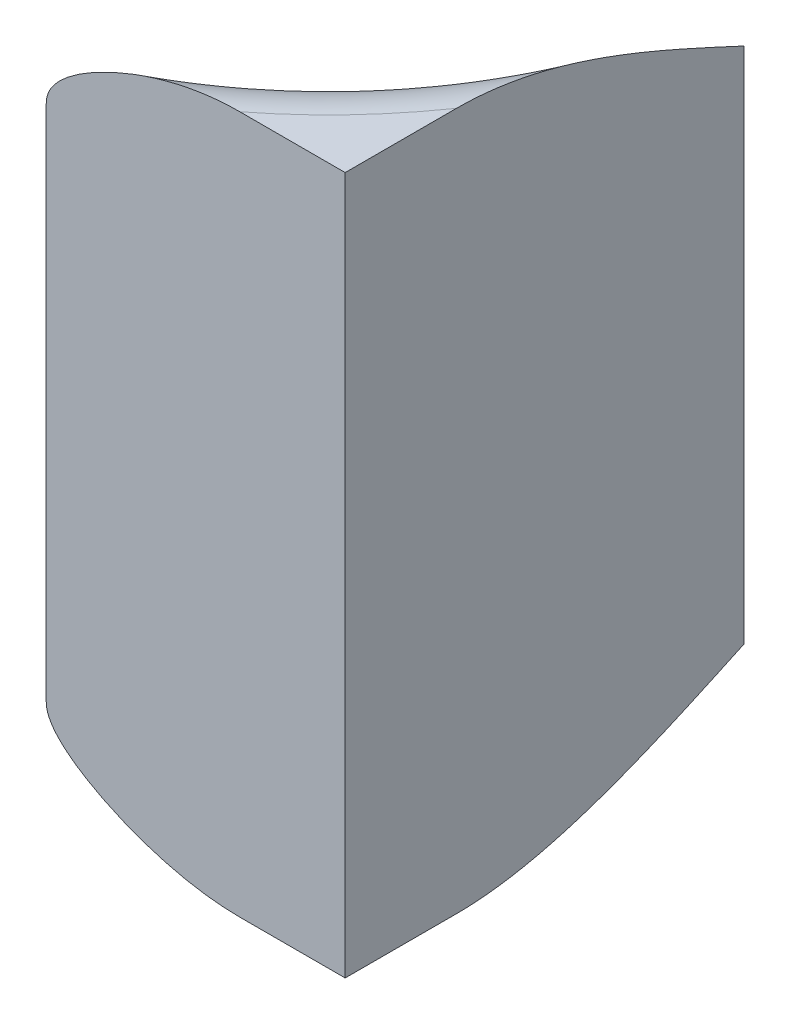
ISO-10303-21;
HEADER;
FILE_DESCRIPTION(('STEP AP214'),'2;1');
FILE_NAME('part.step','',(''),(''),'','','');
FILE_SCHEMA(('AUTOMOTIVE_DESIGN { 1 0 10303 214 1 1 1 1 }'));
ENDSEC;
DATA;
#1=APPLICATION_CONTEXT('core data for automotive mechanical design processes');
#2=APPLICATION_PROTOCOL_DEFINITION('international standard','automotive_design',2000,#1);
#3=PRODUCT_CONTEXT('',#1,'mechanical');
#4=PRODUCT('Part','Part','',(#3));
#5=PRODUCT_RELATED_PRODUCT_CATEGORY('part','',(#4));
#6=PRODUCT_DEFINITION_FORMATION('','',#4);
#7=PRODUCT_DEFINITION_CONTEXT('part definition',#1,'design');
#8=PRODUCT_DEFINITION('design','',#6,#7);
#9=PRODUCT_DEFINITION_SHAPE('','',#8);
#10=(LENGTH_UNIT() NAMED_UNIT(*) SI_UNIT(.MILLI.,.METRE.));
#11=(NAMED_UNIT(*) PLANE_ANGLE_UNIT() SI_UNIT($,.RADIAN.));
#12=(NAMED_UNIT(*) SI_UNIT($,.STERADIAN.) SOLID_ANGLE_UNIT());
#13=UNCERTAINTY_MEASURE_WITH_UNIT(LENGTH_MEASURE(1.E-05),#10,'distance_accuracy_value','');
#14=(GEOMETRIC_REPRESENTATION_CONTEXT(3) GLOBAL_UNCERTAINTY_ASSIGNED_CONTEXT((#13)) GLOBAL_UNIT_ASSIGNED_CONTEXT((#10,
#11,#12)) REPRESENTATION_CONTEXT('',''));
#15=CARTESIAN_POINT('',(0.,0.,0.));
#16=DIRECTION('',(0.,0.,1.));
#17=DIRECTION('',(1.,0.,0.));
#18=AXIS2_PLACEMENT_3D('',#15,#16,#17);
#19=CARTESIAN_POINT('',(-10.8166666667,4.66,-7.40000000000005));
#20=DIRECTION('',(0.,1.,0.));
#21=DIRECTION('',(0.,0.,1.));
#22=AXIS2_PLACEMENT_3D('',#19,#20,#21);
#23=TOROIDAL_SURFACE('',#22,0.506666666667083,0.0900000000000327);
#24=CARTESIAN_POINT('',(-10.8166666667,4.66,-7.4));
#25=DIRECTION('',(0.,1.,0.));
#26=DIRECTION('',(0.,0.,1.));
#27=AXIS2_PLACEMENT_3D('',#24,#25,#26);
#28=CIRCLE('',#27,0.416666666666996);
#29=CARTESIAN_POINT('',(-10.7000000000012,4.66,-7.00000000000432));
#30=VERTEX_POINT('',#29);
#31=CARTESIAN_POINT('',(-10.4000000000165,4.66000000000001,-7.4));
#32=VERTEX_POINT('',#31);
#33=EDGE_CURVE('E73',#30,#32,#28,.T.);
#34=ORIENTED_EDGE('',*,*,#33,.F.);
#35=CARTESIAN_POINT('',(-10.5056825656226,4.75000000000003,-7.));
#36=CARTESIAN_POINT('',(-10.5132166189494,4.74999742310537,-7.));
#37=CARTESIAN_POINT('',(-10.5207410831236,4.74964432556257,-7.));
#38=CARTESIAN_POINT('',(-10.5357271253526,4.74831299039018,-7.));
#39=CARTESIAN_POINT('',(-10.5431887637137,4.74733544403535,-7.));
#40=CARTESIAN_POINT('',(-10.565615866245,4.74354857473161,-7.));
#41=CARTESIAN_POINT('',(-10.5804423440404,4.73988851814925,-7.));
#42=CARTESIAN_POINT('',(-10.6075413991432,4.73127560623273,-7.));
#43=CARTESIAN_POINT('',(-10.6198920431199,4.72655834932829,-7.));
#44=CARTESIAN_POINT('',(-10.6438938127557,4.7157058892291,-7.));
#45=CARTESIAN_POINT('',(-10.6555488642359,4.70957983092415,-7.));
#46=CARTESIAN_POINT('',(-10.6721910248302,4.69860824379118,-7.));
#47=CARTESIAN_POINT('',(-10.6776826500182,4.69457043450713,-7.));
#48=CARTESIAN_POINT('',(-10.6852973350494,4.6877364305963,-7.));
#49=CARTESIAN_POINT('',(-10.6877458574366,4.68531018295774,-7.));
#50=CARTESIAN_POINT('',(-10.6922403730011,4.68010637398092,-7.));
#51=CARTESIAN_POINT('',(-10.6942883916558,4.67733070361523,-7.));
#52=CARTESIAN_POINT('',(-10.6967701299338,4.67288539912957,-7.));
#53=CARTESIAN_POINT('',(-10.697492766043,4.67137971004736,-7.));
#54=CARTESIAN_POINT('',(-10.6986917191209,4.66827581519021,-7.));
#55=CARTESIAN_POINT('',(-10.6991690030425,4.66667800063523,-7.));
#56=CARTESIAN_POINT('',(-10.6996603709422,4.66422119536119,-7.));
#57=CARTESIAN_POINT('',(-10.6997868260883,4.66338398309374,-7.));
#58=CARTESIAN_POINT('',(-10.6999570274957,4.66169809180058,-7.));
#59=CARTESIAN_POINT('',(-10.7000004633706,4.66084938164426,-7.));
#60=CARTESIAN_POINT('',(-10.7000000000304,4.65999999999965,-7.));
#61=B_SPLINE_CURVE_WITH_KNOTS('',3,(#35,#36,#37,#38,#39,#40,#41,#42,#43,#44,#45,#46,#47,#48,#49,
#50,#51,#52,#53,#54,#55,#56,#57,#58,#59,#60),.UNSPECIFIED.,.F.,.F.,(4,2,2,2,2,2,2,2,2,2,2,2,4),
(0.,0.022578809643806,0.0451326674009313,0.0907782215599926,0.130374817381089,0.169721295352092,
0.190088278212477,0.200409303703631,0.210676700002252,0.215671790404664,0.220647040847755,
0.223183415193689,0.225729253936072),.UNSPECIFIED.);
#62=CARTESIAN_POINT('',(-10.5056825656318,4.75000000000003,-7.));
#63=VERTEX_POINT('',#62);
#64=EDGE_CURVE('E68',#63,#30,#61,.T.);
#65=ORIENTED_EDGE('',*,*,#64,.F.);
#66=CARTESIAN_POINT('',(-10.8166666667,4.75000000000003,-7.40000000000005));
#67=DIRECTION('',(0.,1.,0.));
#68=DIRECTION('',(0.,0.,1.));
#69=AXIS2_PLACEMENT_3D('',#66,#67,#68);
#70=CIRCLE('',#69,0.506666666666997);
#71=CARTESIAN_POINT('',(-10.4,4.75000000000002,-7.11172929391481));
#72=VERTEX_POINT('',#71);
#73=EDGE_CURVE('E21',#72,#63,#70,.F.);
#74=ORIENTED_EDGE('',*,*,#73,.F.);
#75=CARTESIAN_POINT('',(-10.4000000000165,4.66,-7.40000000000005));
#76=CARTESIAN_POINT('',(-10.4000000000106,4.66057353697902,-7.39876593217971));
#77=CARTESIAN_POINT('',(-10.4000000000051,4.66114707725404,-7.3975318725381));
#78=CARTESIAN_POINT('',(-10.3999999998878,4.67438755766474,-7.36903846654688));
#79=CARTESIAN_POINT('',(-10.3999999999705,4.68701714266247,-7.34176487370878));
#80=CARTESIAN_POINT('',(-10.4000000000295,4.71046929868652,-7.28639982401045));
#81=CARTESIAN_POINT('',(-10.4000000000059,4.72129301557202,-7.25830889915638));
#82=CARTESIAN_POINT('',(-10.3999999999966,4.73510591602808,-7.21303952326153));
#83=CARTESIAN_POINT('',(-10.3999999999991,4.73947002937005,-7.19629446639567));
#84=CARTESIAN_POINT('',(-10.4000000000009,4.7462101886436,-7.16238876993015));
#85=CARTESIAN_POINT('',(-10.4000000000002,4.74858825840938,-7.14522857177047));
#86=CARTESIAN_POINT('',(-10.3999999999999,4.75017185673886,-7.11659396359466));
#87=CARTESIAN_POINT('',(-10.4,4.75018040274059,-7.10516725747419));
#88=CARTESIAN_POINT('',(-10.4,4.74860990127612,-7.08241440387086));
#89=CARTESIAN_POINT('',(-10.4,4.74703341668447,-7.071088123832));
#90=CARTESIAN_POINT('',(-10.4,4.74274129799291,-7.05266875286371));
#91=CARTESIAN_POINT('',(-10.4,4.74059441559002,-7.04544444061446));
#92=CARTESIAN_POINT('',(-10.4,4.73526862467402,-7.03138042256439));
#93=CARTESIAN_POINT('',(-10.4,4.73209109148528,-7.02454021839214));
#94=CARTESIAN_POINT('',(-10.4,4.72556115071384,-7.01326965086402));
#95=CARTESIAN_POINT('',(-10.4,4.72248064984309,-7.00868262516119));
#96=CARTESIAN_POINT('',(-10.4,4.7156395825345,-7.00004403707582));
#97=CARTESIAN_POINT('',(-10.4,4.71188001137775,-6.99599170586257));
#98=CARTESIAN_POINT('',(-10.4,4.704568111491,-6.98944200335155));
#99=CARTESIAN_POINT('',(-10.4,4.70114771606998,-6.98679800747728));
#100=CARTESIAN_POINT('',(-10.4,4.69391897145049,-6.98210160144133));
#101=CARTESIAN_POINT('',(-10.4,4.69011081413786,-6.98004890058163));
#102=CARTESIAN_POINT('',(-10.4,4.68214938590761,-6.97665091319764));
#103=CARTESIAN_POINT('',(-10.4,4.67799353444282,-6.97531158300465));
#104=CARTESIAN_POINT('',(-10.4,4.66949890803968,-6.9734751715656));
#105=CARTESIAN_POINT('',(-10.4,4.66516026303975,-6.97297750204435));
#106=CARTESIAN_POINT('',(-10.4,4.65705818266612,-6.9728740612062));
#107=CARTESIAN_POINT('',(-10.4,4.65329576804798,-6.97315746171731));
#108=CARTESIAN_POINT('',(-10.4,4.64587880107731,-6.9743658444841));
#109=CARTESIAN_POINT('',(-10.4,4.64222417551811,-6.97529038032983));
#110=CARTESIAN_POINT('',(-10.4,4.63518578003019,-6.97769876124067));
#111=CARTESIAN_POINT('',(-10.4,4.63179814178746,-6.97917145757133));
#112=CARTESIAN_POINT('',(-10.4,4.62527171042037,-6.98260485592213));
#113=CARTESIAN_POINT('',(-10.4,4.6221335752226,-6.98456679520595));
#114=CARTESIAN_POINT('',(-10.4,4.61492728640319,-6.98978081093197));
#115=CARTESIAN_POINT('',(-10.4,4.61100444446199,-6.9932322159826));
#116=CARTESIAN_POINT('',(-10.4,4.60379018876413,-7.00070636101534));
#117=CARTESIAN_POINT('',(-10.4,4.6004951804368,-7.00472560401652));
#118=CARTESIAN_POINT('',(-10.4,4.59751380231215,-7.0089353053044));
#119=B_SPLINE_CURVE_WITH_KNOTS('',3,(#75,#76,#77,#78,#79,#80,#81,#82,#83,#84,#85,#86,#87,#88,
#89,#90,#91,#92,#93,#94,#95,#96,#97,#98,#99,#100,#101,#102,#103,#104,#105,#106,#107,#108,#109,
#110,#111,#112,#113,#114,#115,#116,#117,#118),.UNSPECIFIED.,.F.,.F.,(4,2,2,2,2,2,2,2,2,2,2,2,2,
2,2,2,2,2,2,2,2,4),(0.,0.00408248290560845,0.0942588842744634,0.184377847506195,
0.236215220765518,0.287999705607145,0.322202140646665,0.356349361732395,0.378898897002245,
0.401418464597078,0.417941062871931,0.434439638410806,0.447359523736499,0.460273046383189,
0.473292765015203,0.486303379803112,0.497566283713394,0.508821353348178,0.519859016918387,
0.530924882246194,0.546521676572161,0.562026297908484),.UNSPECIFIED.);
#120=EDGE_CURVE('E65',#32,#72,#119,.T.);
#121=ORIENTED_EDGE('',*,*,#120,.F.);
#122=EDGE_LOOP('',(#34,#65,#74,#121));
#123=FACE_BOUND('',#122,.T.);
#124=ADVANCED_FACE('F17',(#123),#23,.T.);
#125=CARTESIAN_POINT('',(-10.8166666667,4.14,-7.4));
#126=DIRECTION('',(0.,1.,0.));
#127=DIRECTION('',(0.,0.,1.));
#128=AXIS2_PLACEMENT_3D('',#125,#126,#127);
#129=CYLINDRICAL_SURFACE('',#128,0.416666666666996);
#130=DIRECTION('',(0.,-1.,0.));
#131=VECTOR('',#130,1.);
#132=CARTESIAN_POINT('',(-10.7,4.400000000002,-7.));
#133=LINE('',#132,#131);
#134=CARTESIAN_POINT('',(-10.7000000000162,4.14,-7.));
#135=VERTEX_POINT('',#134);
#136=EDGE_CURVE('E84',#30,#135,#133,.T.);
#137=ORIENTED_EDGE('',*,*,#136,.F.);
#138=ORIENTED_EDGE('',*,*,#33,.T.);
#139=DIRECTION('',(0.,1.,0.));
#140=VECTOR('',#139,1.);
#141=CARTESIAN_POINT('',(-10.4,4.39999999999571,-7.4));
#142=LINE('',#141,#140);
#143=CARTESIAN_POINT('',(-10.4000000000165,4.14,-7.4));
#144=VERTEX_POINT('',#143);
#145=EDGE_CURVE('E82',#144,#32,#142,.T.);
#146=ORIENTED_EDGE('',*,*,#145,.F.);
#147=CARTESIAN_POINT('',(-10.8166666667,4.14,-7.40000000000001));
#148=DIRECTION('',(0.,1.,0.));
#149=DIRECTION('',(0.,0.,1.));
#150=AXIS2_PLACEMENT_3D('',#147,#148,#149);
#151=CIRCLE('',#150,0.416666666666982);
#152=EDGE_CURVE('E72',#135,#144,#151,.T.);
#153=ORIENTED_EDGE('',*,*,#152,.F.);
#154=EDGE_LOOP('',(#137,#138,#146,#153));
#155=FACE_BOUND('',#154,.T.);
#156=ADVANCED_FACE('F104',(#155),#129,.F.);
#157=CARTESIAN_POINT('',(-10.5066825656155,4.75,-7.11272929390606));
#158=DIRECTION('',(0.,1.,0.));
#159=DIRECTION('',(0.,0.,1.));
#160=AXIS2_PLACEMENT_3D('',#157,#158,#159);
#161=PLANE('',#160);
#162=DIRECTION('',(-1.,0.,0.));
#163=VECTOR('',#162,1.);
#164=CARTESIAN_POINT('',(-10.5500000000161,4.75,-7.));
#165=LINE('',#164,#163);
#166=CARTESIAN_POINT('',(-10.4,4.75,-7.));
#167=VERTEX_POINT('',#166);
#168=EDGE_CURVE('E76',#167,#63,#165,.T.);
#169=ORIENTED_EDGE('',*,*,#168,.F.);
#170=DIRECTION('',(0.,0.,1.));
#171=VECTOR('',#170,1.);
#172=CARTESIAN_POINT('',(-10.4,4.75,-7.20651086194688));
#173=LINE('',#172,#171);
#174=EDGE_CURVE('E74',#72,#167,#173,.T.);
#175=ORIENTED_EDGE('',*,*,#174,.F.);
#176=ORIENTED_EDGE('',*,*,#73,.T.);
#177=EDGE_LOOP('',(#169,#175,#176));
#178=FACE_BOUND('',#177,.T.);
#179=ADVANCED_FACE('F75',(#178),#161,.T.);
#180=CARTESIAN_POINT('',(-10.8166666667,4.14,-7.40000000000001));
#181=DIRECTION('',(0.,-1.,0.));
#182=DIRECTION('',(0.,0.,-1.));
#183=AXIS2_PLACEMENT_3D('',#180,#181,#182);
#184=TOROIDAL_SURFACE('',#183,0.506666666666921,0.089999999999977);
#185=CARTESIAN_POINT('',(-10.8166666667,4.05000000000002,-7.40000000000001));
#186=DIRECTION('',(0.,-1.,0.));
#187=DIRECTION('',(0.,0.,-1.));
#188=AXIS2_PLACEMENT_3D('',#185,#186,#187);
#189=CIRCLE('',#188,0.506666666667001);
#190=CARTESIAN_POINT('',(-10.5056825656283,4.05000000000002,-7.00000000000994));
#191=VERTEX_POINT('',#190);
#192=CARTESIAN_POINT('',(-10.4,4.05000000000002,-7.11172929392793));
#193=VERTEX_POINT('',#192);
#194=EDGE_CURVE('E121',#191,#193,#189,.F.);
#195=ORIENTED_EDGE('',*,*,#194,.F.);
#196=CARTESIAN_POINT('',(-10.7000000000324,4.14,-7.));
#197=CARTESIAN_POINT('',(-10.700007577163,4.13820255979553,-7.));
#198=CARTESIAN_POINT('',(-10.6998079863509,4.13641802016421,-7.));
#199=CARTESIAN_POINT('',(-10.6990729896062,4.13295402144104,-7.));
#200=CARTESIAN_POINT('',(-10.6985442314676,4.13127318943098,-7.));
#201=CARTESIAN_POINT('',(-10.6970169233433,4.12751190526443,-7.));
#202=CARTESIAN_POINT('',(-10.695923012181,4.12547160041116,-7.));
#203=CARTESIAN_POINT('',(-10.6934314477973,4.12156952362007,-7.));
#204=CARTESIAN_POINT('',(-10.6920311893354,4.11970949361497,-7.));
#205=CARTESIAN_POINT('',(-10.68676409411,4.11343589457287,-7.));
#206=CARTESIAN_POINT('',(-10.6823935945665,4.10945631908832,-7.));
#207=CARTESIAN_POINT('',(-10.6731737475399,4.10211047927655,-7.));
#208=CARTESIAN_POINT('',(-10.6683218557314,4.09874777403992,-7.));
#209=CARTESIAN_POINT('',(-10.6563237931639,4.09117300054285,-7.));
#210=CARTESIAN_POINT('',(-10.649045056454,4.0871694075582,-7.));
#211=CARTESIAN_POINT('',(-10.6341745878265,4.07978675279661,-7.));
#212=CARTESIAN_POINT('',(-10.6265823203104,4.07640881877299,-7.));
#213=CARTESIAN_POINT('',(-10.6035011341586,4.0671310481548,-7.));
#214=CARTESIAN_POINT('',(-10.5876652281306,4.06206245620282,-7.));
#215=CARTESIAN_POINT('',(-10.5607436195397,4.05561305222998,-7.));
#216=CARTESIAN_POINT('',(-10.5498141409634,4.0535672869932,-7.));
#217=CARTESIAN_POINT('',(-10.5278279480941,4.05076938935799,-7.));
#218=CARTESIAN_POINT('',(-10.5167717147524,4.05001338863396,-7.));
#219=CARTESIAN_POINT('',(-10.5056825656226,4.05000000000002,-7.));
#220=B_SPLINE_CURVE_WITH_KNOTS('',3,(#196,#197,#198,#199,#200,#201,#202,#203,#204,#205,#206,
#207,#208,#209,#210,#211,#212,#213,#214,#215,#216,#217,#218,#219),.UNSPECIFIED.,.F.,.F.,(4,2,2,
2,2,2,2,2,2,2,2,4),(0.,0.00536075382319684,0.0106166062475223,0.0175220325716201,
0.0244886399425116,0.042084699303737,0.0597792898737989,0.0846486742987348,0.109562458701917,
0.159243487630364,0.192536219062546,0.225728920588741),.UNSPECIFIED.);
#221=EDGE_CURVE('E115',#135,#191,#220,.T.);
#222=ORIENTED_EDGE('',*,*,#221,.F.);
#223=ORIENTED_EDGE('',*,*,#152,.T.);
#224=CARTESIAN_POINT('',(-10.4,4.05000000000002,-7.11172929391627));
#225=CARTESIAN_POINT('',(-10.3999999999995,4.05000817152894,-7.12226420726173));
#226=CARTESIAN_POINT('',(-10.3999999999998,4.05059717561127,-7.13277700139082));
#227=CARTESIAN_POINT('',(-10.4000000000002,4.05273400876788,-7.15367604087738));
#228=CARTESIAN_POINT('',(-10.4000000000005,4.05427897807583,-7.16406256980887));
#229=CARTESIAN_POINT('',(-10.3999999999991,4.06000691356495,-7.19476484200921));
#230=CARTESIAN_POINT('',(-10.3999999999955,4.06529255151798,-7.214869004615));
#231=CARTESIAN_POINT('',(-10.4000000000064,4.08025199544223,-7.2624459869251));
#232=CARTESIAN_POINT('',(-10.4000000000288,4.0908359342891,-7.28961338283761));
#233=CARTESIAN_POINT('',(-10.3999999999711,4.11369108787006,-7.3432937460839));
#234=CARTESIAN_POINT('',(-10.3999999998908,4.12596819425887,-7.36980402929783));
#235=CARTESIAN_POINT('',(-10.4000000000051,4.13885292511562,-7.39753187956165));
#236=CARTESIAN_POINT('',(-10.4000000000106,4.13942646567525,-7.39876593945853));
#237=CARTESIAN_POINT('',(-10.4000000000165,4.14,-7.40000000000001));
#238=B_SPLINE_CURVE_WITH_KNOTS('',3,(#224,#225,#226,#227,#228,#229,#230,#231,#232,#233,#234,
#235,#236,#237),.UNSPECIFIED.,.F.,.F.,(4,2,2,2,2,2,4),(0.,0.0315568755860393,0.0630198022783467,
0.125216483327412,0.212547911362089,0.300191273585335,0.304273756561026),.UNSPECIFIED.);
#239=EDGE_CURVE('E77',#193,#144,#238,.T.);
#240=ORIENTED_EDGE('',*,*,#239,.F.);
#241=EDGE_LOOP('',(#195,#222,#223,#240));
#242=FACE_BOUND('',#241,.T.);
#243=ADVANCED_FACE('F110',(#242),#184,.T.);
#244=CARTESIAN_POINT('',(-10.4,4.7510000000086,-6.999));
#245=DIRECTION('',(1.,0.,0.));
#246=DIRECTION('',(0.,-1.,0.));
#247=AXIS2_PLACEMENT_3D('',#244,#245,#246);
#248=PLANE('',#247);
#249=ORIENTED_EDGE('',*,*,#145,.T.);
#250=ORIENTED_EDGE('',*,*,#120,.T.);
#251=ORIENTED_EDGE('',*,*,#174,.T.);
#252=DIRECTION('',(0.,1.,0.));
#253=VECTOR('',#252,1.);
#254=CARTESIAN_POINT('',(-10.4,4.400000000002,-7.));
#255=LINE('',#254,#253);
#256=CARTESIAN_POINT('',(-10.4,4.05,-7.));
#257=VERTEX_POINT('',#256);
#258=EDGE_CURVE('E36',#257,#167,#255,.T.);
#259=ORIENTED_EDGE('',*,*,#258,.F.);
#260=DIRECTION('',(0.,0.,1.));
#261=VECTOR('',#260,1.);
#262=CARTESIAN_POINT('',(-10.4,4.05,-7.05586464695303));
#263=LINE('',#262,#261);
#264=EDGE_CURVE('E27',#193,#257,#263,.T.);
#265=ORIENTED_EDGE('',*,*,#264,.F.);
#266=ORIENTED_EDGE('',*,*,#239,.T.);
#267=EDGE_LOOP('',(#249,#250,#251,#259,#265,#266));
#268=FACE_BOUND('',#267,.T.);
#269=ADVANCED_FACE('F79',(#268),#248,.T.);
#270=CARTESIAN_POINT('',(-10.7010000000321,4.75100000000797,-7.));
#271=DIRECTION('',(0.,0.,1.));
#272=DIRECTION('',(0.,-1.,0.));
#273=AXIS2_PLACEMENT_3D('',#270,#271,#272);
#274=PLANE('',#273);
#275=ORIENTED_EDGE('',*,*,#258,.T.);
#276=ORIENTED_EDGE('',*,*,#168,.T.);
#277=ORIENTED_EDGE('',*,*,#64,.T.);
#278=ORIENTED_EDGE('',*,*,#136,.T.);
#279=ORIENTED_EDGE('',*,*,#221,.T.);
#280=DIRECTION('',(-1.,0.,0.));
#281=VECTOR('',#280,1.);
#282=CARTESIAN_POINT('',(-10.4528412828077,4.05,-7.));
#283=LINE('',#282,#281);
#284=EDGE_CURVE('E11',#257,#191,#283,.T.);
#285=ORIENTED_EDGE('',*,*,#284,.F.);
#286=EDGE_LOOP('',(#275,#276,#277,#278,#279,#285));
#287=FACE_BOUND('',#286,.T.);
#288=ADVANCED_FACE('F123',(#287),#274,.T.);
#289=CARTESIAN_POINT('',(-10.5066825656155,4.05,-6.999));
#290=DIRECTION('',(0.,-1.,0.));
#291=DIRECTION('',(0.,0.,-1.));
#292=AXIS2_PLACEMENT_3D('',#289,#290,#291);
#293=PLANE('',#292);
#294=ORIENTED_EDGE('',*,*,#264,.T.);
#295=ORIENTED_EDGE('',*,*,#284,.T.);
#296=ORIENTED_EDGE('',*,*,#194,.T.);
#297=EDGE_LOOP('',(#294,#295,#296));
#298=FACE_BOUND('',#297,.T.);
#299=ADVANCED_FACE('F19',(#298),#293,.T.);
#300=CLOSED_SHELL('',(#124,#156,#179,#243,#269,#288,#299));
#301=MANIFOLD_SOLID_BREP('B1',#300);
#302=ADVANCED_BREP_SHAPE_REPRESENTATION('',(#18,#301),#14);
#303=SHAPE_DEFINITION_REPRESENTATION(#9,#302);
ENDSEC;
END-ISO-10303-21;
